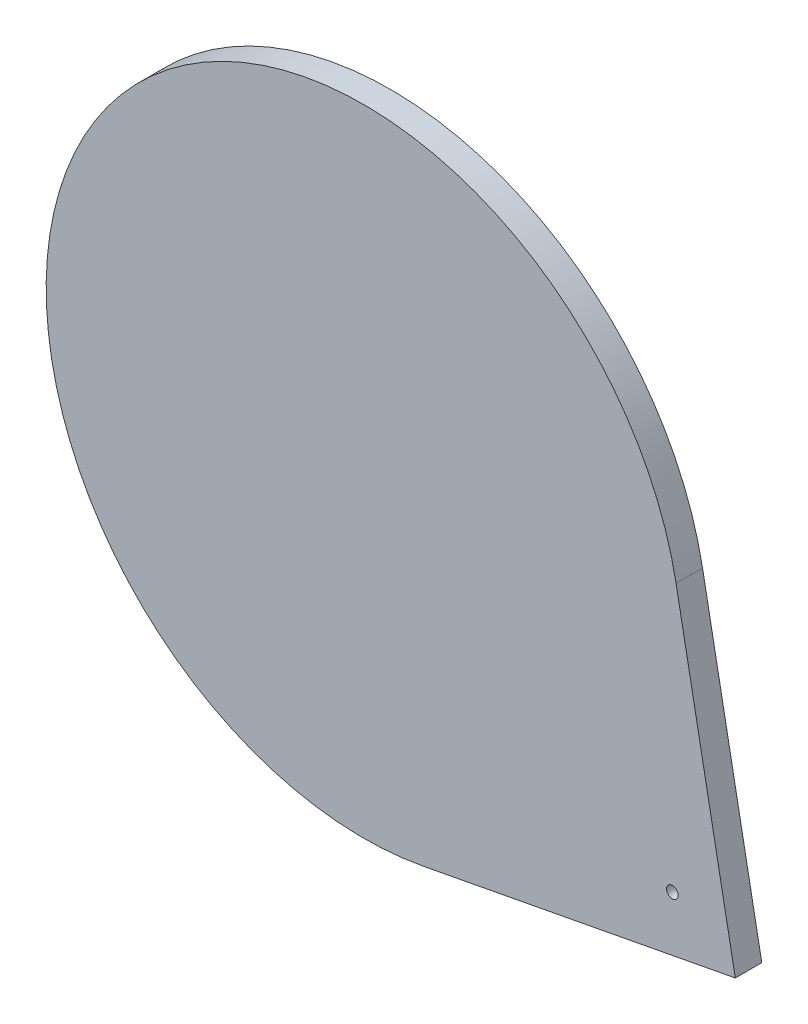
ISO-10303-21;
HEADER;
FILE_DESCRIPTION(('STEP AP214'),'2;1');
FILE_NAME('part.step','',(''),(''),'','','');
FILE_SCHEMA(('AUTOMOTIVE_DESIGN { 1 0 10303 214 1 1 1 1 }'));
ENDSEC;
DATA;
#1=APPLICATION_CONTEXT('core data for automotive mechanical design processes');
#2=APPLICATION_PROTOCOL_DEFINITION('international standard','automotive_design',2000,#1);
#3=PRODUCT_CONTEXT('',#1,'mechanical');
#4=PRODUCT('Part','Part','',(#3));
#5=PRODUCT_RELATED_PRODUCT_CATEGORY('part','',(#4));
#6=PRODUCT_DEFINITION_FORMATION('','',#4);
#7=PRODUCT_DEFINITION_CONTEXT('part definition',#1,'design');
#8=PRODUCT_DEFINITION('design','',#6,#7);
#9=PRODUCT_DEFINITION_SHAPE('','',#8);
#10=(LENGTH_UNIT() NAMED_UNIT(*) SI_UNIT(.MILLI.,.METRE.));
#11=(NAMED_UNIT(*) PLANE_ANGLE_UNIT() SI_UNIT($,.RADIAN.));
#12=(NAMED_UNIT(*) SI_UNIT($,.STERADIAN.) SOLID_ANGLE_UNIT());
#13=UNCERTAINTY_MEASURE_WITH_UNIT(LENGTH_MEASURE(1.E-05),#10,'distance_accuracy_value','');
#14=(GEOMETRIC_REPRESENTATION_CONTEXT(3) GLOBAL_UNCERTAINTY_ASSIGNED_CONTEXT((#13)) GLOBAL_UNIT_ASSIGNED_CONTEXT((#10,
#11,#12)) REPRESENTATION_CONTEXT('',''));
#15=CARTESIAN_POINT('',(0.,0.,0.));
#16=DIRECTION('',(0.,0.,1.));
#17=DIRECTION('',(1.,0.,0.));
#18=AXIS2_PLACEMENT_3D('',#15,#16,#17);
#19=CARTESIAN_POINT('',(0.,0.,5.));
#20=DIRECTION('',(0.,0.,1.));
#21=DIRECTION('',(1.,0.,0.));
#22=AXIS2_PLACEMENT_3D('',#19,#20,#21);
#23=PLANE('',#22);
#24=CARTESIAN_POINT('',(0.,0.,5.));
#25=DIRECTION('',(0.,0.,1.));
#26=DIRECTION('',(1.,0.,0.));
#27=AXIS2_PLACEMENT_3D('',#24,#25,#26);
#28=CIRCLE('',#27,60.);
#29=CARTESIAN_POINT('',(58.9480506081593,11.1860327863762,5.));
#30=VERTEX_POINT('',#29);
#31=CARTESIAN_POINT('',(11.1860327863763,-58.9480506081594,5.));
#32=VERTEX_POINT('',#31);
#33=EDGE_CURVE('E72',#30,#32,#28,.T.);
#34=ORIENTED_EDGE('',*,*,#33,.T.);
#35=DIRECTION('',(0.982467510135989,0.186433879772937,0.));
#36=VECTOR('',#35,1.);
#37=CARTESIAN_POINT('',(70.1340833945356,-47.7620178217832,5.));
#38=LINE('',#37,#36);
#39=CARTESIAN_POINT('',(70.1340833945356,-47.7620178217832,5.));
#40=VERTEX_POINT('',#39);
#41=EDGE_CURVE('E68',#32,#40,#38,.T.);
#42=ORIENTED_EDGE('',*,*,#41,.T.);
#43=DIRECTION('',(-0.186433879772939,0.982467510135989,0.));
#44=VECTOR('',#43,1.);
#45=CARTESIAN_POINT('',(58.9480506081593,11.1860327863762,5.));
#46=LINE('',#45,#44);
#47=EDGE_CURVE('E48',#40,#30,#46,.T.);
#48=ORIENTED_EDGE('',*,*,#47,.T.);
#49=EDGE_LOOP('',(#34,#42,#48));
#50=FACE_BOUND('',#49,.T.);
#51=CARTESIAN_POINT('',(58.2458857528334,-39.6660353814381,5.));
#52=DIRECTION('',(0.,0.,1.));
#53=DIRECTION('',(1.,0.,0.));
#54=AXIS2_PLACEMENT_3D('',#51,#52,#53);
#55=CIRCLE('',#54,1.1);
#56=CARTESIAN_POINT('',(59.3458857528334,-39.6660353814381,5.));
#57=VERTEX_POINT('',#56);
#58=EDGE_CURVE('E82',#57,#57,#55,.T.);
#59=ORIENTED_EDGE('',*,*,#58,.F.);
#60=EDGE_LOOP('',(#59));
#61=FACE_BOUND('',#60,.T.);
#62=ADVANCED_FACE('F31',(#50,#61),#23,.T.);
#63=CARTESIAN_POINT('',(0.,0.,0.));
#64=DIRECTION('',(0.,0.,1.));
#65=DIRECTION('',(1.,0.,0.));
#66=AXIS2_PLACEMENT_3D('',#63,#64,#65);
#67=PLANE('',#66);
#68=CARTESIAN_POINT('',(0.,0.,0.));
#69=DIRECTION('',(0.,0.,1.));
#70=DIRECTION('',(1.,0.,0.));
#71=AXIS2_PLACEMENT_3D('',#68,#69,#70);
#72=CIRCLE('',#71,60.);
#73=CARTESIAN_POINT('',(58.9480506081593,11.1860327863762,0.));
#74=VERTEX_POINT('',#73);
#75=CARTESIAN_POINT('',(11.1860327863763,-58.9480506081594,0.));
#76=VERTEX_POINT('',#75);
#77=EDGE_CURVE('E79',#74,#76,#72,.T.);
#78=ORIENTED_EDGE('',*,*,#77,.F.);
#79=DIRECTION('',(-0.186433879772939,0.982467510135989,0.));
#80=VECTOR('',#79,1.);
#81=CARTESIAN_POINT('',(58.9480506081593,11.1860327863762,0.));
#82=LINE('',#81,#80);
#83=CARTESIAN_POINT('',(70.1340833945356,-47.7620178217832,0.));
#84=VERTEX_POINT('',#83);
#85=EDGE_CURVE('E65',#84,#74,#82,.T.);
#86=ORIENTED_EDGE('',*,*,#85,.F.);
#87=DIRECTION('',(0.982467510135989,0.186433879772937,0.));
#88=VECTOR('',#87,1.);
#89=CARTESIAN_POINT('',(70.1340833945356,-47.7620178217832,0.));
#90=LINE('',#89,#88);
#91=EDGE_CURVE('E60',#76,#84,#90,.T.);
#92=ORIENTED_EDGE('',*,*,#91,.F.);
#93=EDGE_LOOP('',(#78,#86,#92));
#94=FACE_BOUND('',#93,.T.);
#95=CARTESIAN_POINT('',(58.2458857528334,-39.6660353814381,0.));
#96=DIRECTION('',(0.,0.,1.));
#97=DIRECTION('',(1.,0.,0.));
#98=AXIS2_PLACEMENT_3D('',#95,#96,#97);
#99=CIRCLE('',#98,1.1);
#100=CARTESIAN_POINT('',(59.3458857528334,-39.6660353814381,0.));
#101=VERTEX_POINT('',#100);
#102=EDGE_CURVE('E86',#101,#101,#99,.T.);
#103=ORIENTED_EDGE('',*,*,#102,.T.);
#104=EDGE_LOOP('',(#103));
#105=FACE_BOUND('',#104,.T.);
#106=ADVANCED_FACE('F92',(#94,#105),#67,.F.);
#107=CARTESIAN_POINT('',(0.,0.,5.));
#108=DIRECTION('',(0.,0.,-1.));
#109=DIRECTION('',(-1.,0.,0.));
#110=AXIS2_PLACEMENT_3D('',#107,#108,#109);
#111=CYLINDRICAL_SURFACE('',#110,60.);
#112=ORIENTED_EDGE('',*,*,#77,.T.);
#113=DIRECTION('',(0.,0.,-1.));
#114=VECTOR('',#113,1.);
#115=CARTESIAN_POINT('',(11.1860327863763,-58.9480506081594,5.));
#116=LINE('',#115,#114);
#117=EDGE_CURVE('E11',#32,#76,#116,.T.);
#118=ORIENTED_EDGE('',*,*,#117,.F.);
#119=ORIENTED_EDGE('',*,*,#33,.F.);
#120=DIRECTION('',(0.,0.,-1.));
#121=VECTOR('',#120,1.);
#122=CARTESIAN_POINT('',(58.9480506081593,11.1860327863762,5.));
#123=LINE('',#122,#121);
#124=EDGE_CURVE('E80',#30,#74,#123,.T.);
#125=ORIENTED_EDGE('',*,*,#124,.T.);
#126=EDGE_LOOP('',(#112,#118,#119,#125));
#127=FACE_BOUND('',#126,.T.);
#128=ADVANCED_FACE('F33',(#127),#111,.T.);
#129=CARTESIAN_POINT('',(70.1340833945356,-47.7620178217832,5.));
#130=DIRECTION('',(-0.186433879772937,0.982467510135989,0.));
#131=DIRECTION('',(-0.982467510135989,-0.186433879772937,0.));
#132=AXIS2_PLACEMENT_3D('',#129,#130,#131);
#133=PLANE('',#132);
#134=ORIENTED_EDGE('',*,*,#91,.T.);
#135=DIRECTION('',(0.,0.,-1.));
#136=VECTOR('',#135,1.);
#137=CARTESIAN_POINT('',(70.1340833945356,-47.7620178217832,5.));
#138=LINE('',#137,#136);
#139=EDGE_CURVE('E40',#40,#84,#138,.T.);
#140=ORIENTED_EDGE('',*,*,#139,.F.);
#141=ORIENTED_EDGE('',*,*,#41,.F.);
#142=ORIENTED_EDGE('',*,*,#117,.T.);
#143=EDGE_LOOP('',(#134,#140,#141,#142));
#144=FACE_BOUND('',#143,.T.);
#145=ADVANCED_FACE('F69',(#144),#133,.F.);
#146=CARTESIAN_POINT('',(58.9480506081593,11.1860327863762,5.));
#147=DIRECTION('',(-0.982467510135989,-0.186433879772939,0.));
#148=DIRECTION('',(0.186433879772939,-0.982467510135989,0.));
#149=AXIS2_PLACEMENT_3D('',#146,#147,#148);
#150=PLANE('',#149);
#151=ORIENTED_EDGE('',*,*,#85,.T.);
#152=ORIENTED_EDGE('',*,*,#124,.F.);
#153=ORIENTED_EDGE('',*,*,#47,.F.);
#154=ORIENTED_EDGE('',*,*,#139,.T.);
#155=EDGE_LOOP('',(#151,#152,#153,#154));
#156=FACE_BOUND('',#155,.T.);
#157=ADVANCED_FACE('F91',(#156),#150,.F.);
#158=CARTESIAN_POINT('',(58.2458857528334,-39.6660353814381,5.));
#159=DIRECTION('',(0.,0.,-1.));
#160=DIRECTION('',(-1.,0.,0.));
#161=AXIS2_PLACEMENT_3D('',#158,#159,#160);
#162=CYLINDRICAL_SURFACE('',#161,1.1);
#163=ORIENTED_EDGE('',*,*,#58,.T.);
#164=EDGE_LOOP('',(#163));
#165=FACE_BOUND('',#164,.T.);
#166=ORIENTED_EDGE('',*,*,#102,.F.);
#167=EDGE_LOOP('',(#166));
#168=FACE_BOUND('',#167,.T.);
#169=ADVANCED_FACE('F100',(#165,#168),#162,.F.);
#170=CLOSED_SHELL('',(#62,#106,#128,#145,#157,#169));
#171=MANIFOLD_SOLID_BREP('B2',#170);
#172=ADVANCED_BREP_SHAPE_REPRESENTATION('',(#18,#171),#14);
#173=SHAPE_DEFINITION_REPRESENTATION(#9,#172);
ENDSEC;
END-ISO-10303-21;
